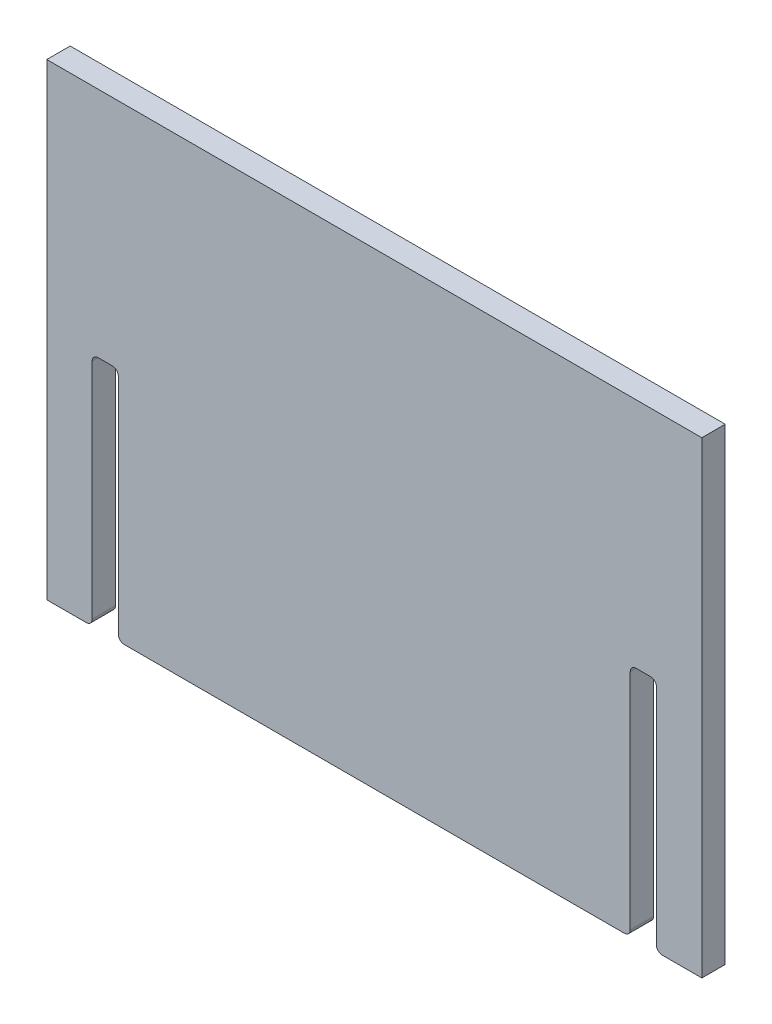
ISO-10303-21;
HEADER;
FILE_DESCRIPTION(('STEP AP214'),'2;1');
FILE_NAME('part.step','',(''),(''),'','','');
FILE_SCHEMA(('AUTOMOTIVE_DESIGN { 1 0 10303 214 1 1 1 1 }'));
ENDSEC;
DATA;
#1=APPLICATION_CONTEXT('core data for automotive mechanical design processes');
#2=APPLICATION_PROTOCOL_DEFINITION('international standard','automotive_design',2000,#1);
#3=PRODUCT_CONTEXT('',#1,'mechanical');
#4=PRODUCT('Part','Part','',(#3));
#5=PRODUCT_RELATED_PRODUCT_CATEGORY('part','',(#4));
#6=PRODUCT_DEFINITION_FORMATION('','',#4);
#7=PRODUCT_DEFINITION_CONTEXT('part definition',#1,'design');
#8=PRODUCT_DEFINITION('design','',#6,#7);
#9=PRODUCT_DEFINITION_SHAPE('','',#8);
#10=(LENGTH_UNIT() NAMED_UNIT(*) SI_UNIT(.MILLI.,.METRE.));
#11=(NAMED_UNIT(*) PLANE_ANGLE_UNIT() SI_UNIT($,.RADIAN.));
#12=(NAMED_UNIT(*) SI_UNIT($,.STERADIAN.) SOLID_ANGLE_UNIT());
#13=UNCERTAINTY_MEASURE_WITH_UNIT(LENGTH_MEASURE(1.E-05),#10,'distance_accuracy_value','');
#14=(GEOMETRIC_REPRESENTATION_CONTEXT(3) GLOBAL_UNCERTAINTY_ASSIGNED_CONTEXT((#13)) GLOBAL_UNIT_ASSIGNED_CONTEXT((#10,
#11,#12)) REPRESENTATION_CONTEXT('',''));
#15=CARTESIAN_POINT('',(0.,0.,0.));
#16=DIRECTION('',(0.,0.,1.));
#17=DIRECTION('',(1.,0.,0.));
#18=AXIS2_PLACEMENT_3D('',#15,#16,#17);
#19=CARTESIAN_POINT('',(1294.20395565763,-24.1798672236195,6.35));
#20=DIRECTION('',(1.,0.,0.));
#21=DIRECTION('',(0.,0.,-1.));
#22=AXIS2_PLACEMENT_3D('',#19,#20,#21);
#23=PLANE('',#22);
#24=DIRECTION('',(0.,-1.,0.));
#25=VECTOR('',#24,1.);
#26=CARTESIAN_POINT('',(1294.20395565763,-24.1798672236195,-6.35));
#27=LINE('',#26,#25);
#28=CARTESIAN_POINT('',(1294.20395565763,-24.1798672236195,-6.35));
#29=VERTEX_POINT('',#28);
#30=CARTESIAN_POINT('',(1294.20395565763,-278.17986722362,-6.35));
#31=VERTEX_POINT('',#30);
#32=EDGE_CURVE('E221',#29,#31,#27,.T.);
#33=ORIENTED_EDGE('',*,*,#32,.T.);
#34=DIRECTION('',(0.,0.,-1.));
#35=VECTOR('',#34,1.);
#36=CARTESIAN_POINT('',(1294.20395565763,-278.17986722362,6.35));
#37=LINE('',#36,#35);
#38=CARTESIAN_POINT('',(1294.20395565763,-278.17986722362,6.35));
#39=VERTEX_POINT('',#38);
#40=EDGE_CURVE('E200',#39,#31,#37,.T.);
#41=ORIENTED_EDGE('',*,*,#40,.F.);
#42=DIRECTION('',(0.,-1.,0.));
#43=VECTOR('',#42,1.);
#44=CARTESIAN_POINT('',(1294.20395565763,-24.1798672236195,6.35));
#45=LINE('',#44,#43);
#46=CARTESIAN_POINT('',(1294.20395565763,-24.1798672236195,6.35));
#47=VERTEX_POINT('',#46);
#48=EDGE_CURVE('E207',#47,#39,#45,.T.);
#49=ORIENTED_EDGE('',*,*,#48,.F.);
#50=DIRECTION('',(0.,0.,-1.));
#51=VECTOR('',#50,1.);
#52=CARTESIAN_POINT('',(1294.20395565763,-24.1798672236195,6.35));
#53=LINE('',#52,#51);
#54=EDGE_CURVE('E423',#47,#29,#53,.T.);
#55=ORIENTED_EDGE('',*,*,#54,.T.);
#56=EDGE_LOOP('',(#33,#41,#49,#55));
#57=FACE_BOUND('',#56,.T.);
#58=ADVANCED_FACE('F48',(#57),#23,.F.);
#59=CARTESIAN_POINT('',(1294.20395565763,-278.17986722362,6.35));
#60=DIRECTION('',(0.,1.,0.));
#61=DIRECTION('',(0.,0.,1.));
#62=AXIS2_PLACEMENT_3D('',#59,#60,#61);
#63=PLANE('',#62);
#64=DIRECTION('',(1.,0.,0.));
#65=VECTOR('',#64,1.);
#66=CARTESIAN_POINT('',(1294.20395565763,-278.17986722362,-6.35));
#67=LINE('',#66,#65);
#68=CARTESIAN_POINT('',(1315.66695565763,-278.17986722362,-6.35));
#69=VERTEX_POINT('',#68);
#70=EDGE_CURVE('E273',#31,#69,#67,.T.);
#71=ORIENTED_EDGE('',*,*,#70,.T.);
#72=DIRECTION('',(0.,0.,-1.));
#73=VECTOR('',#72,1.);
#74=CARTESIAN_POINT('',(1315.66695565763,-278.17986722362,6.35));
#75=LINE('',#74,#73);
#76=CARTESIAN_POINT('',(1315.66695565763,-278.17986722362,6.35));
#77=VERTEX_POINT('',#76);
#78=EDGE_CURVE('E203',#69,#77,#75,.F.);
#79=ORIENTED_EDGE('',*,*,#78,.T.);
#80=DIRECTION('',(1.,0.,0.));
#81=VECTOR('',#80,1.);
#82=CARTESIAN_POINT('',(1294.20395565763,-278.17986722362,6.35));
#83=LINE('',#82,#81);
#84=EDGE_CURVE('E195',#39,#77,#83,.T.);
#85=ORIENTED_EDGE('',*,*,#84,.F.);
#86=ORIENTED_EDGE('',*,*,#40,.T.);
#87=EDGE_LOOP('',(#71,#79,#85,#86));
#88=FACE_BOUND('',#87,.T.);
#89=ADVANCED_FACE('F198',(#88),#63,.F.);
#90=CARTESIAN_POINT('',(1318.84195565763,-278.17986722362,6.35));
#91=DIRECTION('',(-1.,0.,0.));
#92=DIRECTION('',(0.,0.,1.));
#93=AXIS2_PLACEMENT_3D('',#90,#91,#92);
#94=PLANE('',#93);
#95=DIRECTION('',(0.,1.,0.));
#96=VECTOR('',#95,1.);
#97=CARTESIAN_POINT('',(1318.84195565763,-278.17986722362,6.35));
#98=LINE('',#97,#96);
#99=CARTESIAN_POINT('',(1318.84195565763,-275.00486722362,6.35));
#100=VERTEX_POINT('',#99);
#101=CARTESIAN_POINT('',(1318.84195565763,-153.59286722362,6.35));
#102=VERTEX_POINT('',#101);
#103=EDGE_CURVE('E206',#100,#102,#98,.T.);
#104=ORIENTED_EDGE('',*,*,#103,.F.);
#105=DIRECTION('',(0.,0.,-1.));
#106=VECTOR('',#105,1.);
#107=CARTESIAN_POINT('',(1318.84195565763,-275.00486722362,6.35));
#108=LINE('',#107,#106);
#109=CARTESIAN_POINT('',(1318.84195565763,-275.00486722362,-6.35));
#110=VERTEX_POINT('',#109);
#111=EDGE_CURVE('E338',#100,#110,#108,.T.);
#112=ORIENTED_EDGE('',*,*,#111,.T.);
#113=DIRECTION('',(0.,1.,0.));
#114=VECTOR('',#113,1.);
#115=CARTESIAN_POINT('',(1318.84195565763,-278.17986722362,-6.35));
#116=LINE('',#115,#114);
#117=CARTESIAN_POINT('',(1318.84195565763,-153.59286722362,-6.35));
#118=VERTEX_POINT('',#117);
#119=EDGE_CURVE('E269',#110,#118,#116,.T.);
#120=ORIENTED_EDGE('',*,*,#119,.T.);
#121=DIRECTION('',(0.,0.,-1.));
#122=VECTOR('',#121,1.);
#123=CARTESIAN_POINT('',(1318.84195565763,-153.59286722362,6.35));
#124=LINE('',#123,#122);
#125=EDGE_CURVE('E335',#118,#102,#124,.F.);
#126=ORIENTED_EDGE('',*,*,#125,.T.);
#127=EDGE_LOOP('',(#104,#112,#120,#126));
#128=FACE_BOUND('',#127,.T.);
#129=ADVANCED_FACE('F386',(#128),#94,.F.);
#130=CARTESIAN_POINT('',(1319.60395565763,-150.41786722362,6.35));
#131=DIRECTION('',(0.,1.,0.));
#132=DIRECTION('',(0.,0.,1.));
#133=AXIS2_PLACEMENT_3D('',#130,#131,#132);
#134=PLANE('',#133);
#135=DIRECTION('',(1.,0.,0.));
#136=VECTOR('',#135,1.);
#137=CARTESIAN_POINT('',(1319.60395565763,-150.41786722362,-6.35));
#138=LINE('',#137,#136);
#139=CARTESIAN_POINT('',(1322.01695565763,-150.41786722362,-6.35));
#140=VERTEX_POINT('',#139);
#141=CARTESIAN_POINT('',(1329.89095565763,-150.41786722362,-6.35));
#142=VERTEX_POINT('',#141);
#143=EDGE_CURVE('E265',#140,#142,#138,.T.);
#144=ORIENTED_EDGE('',*,*,#143,.T.);
#145=DIRECTION('',(0.,0.,-1.));
#146=VECTOR('',#145,1.);
#147=CARTESIAN_POINT('',(1329.89095565763,-150.41786722362,6.35));
#148=LINE('',#147,#146);
#149=CARTESIAN_POINT('',(1329.89095565763,-150.41786722362,6.35));
#150=VERTEX_POINT('',#149);
#151=EDGE_CURVE('E355',#142,#150,#148,.F.);
#152=ORIENTED_EDGE('',*,*,#151,.T.);
#153=DIRECTION('',(1.,0.,0.));
#154=VECTOR('',#153,1.);
#155=CARTESIAN_POINT('',(1319.60395565763,-150.41786722362,6.35));
#156=LINE('',#155,#154);
#157=CARTESIAN_POINT('',(1322.01695565763,-150.41786722362,6.35));
#158=VERTEX_POINT('',#157);
#159=EDGE_CURVE('E277',#158,#150,#156,.T.);
#160=ORIENTED_EDGE('',*,*,#159,.F.);
#161=DIRECTION('',(0.,0.,-1.));
#162=VECTOR('',#161,1.);
#163=CARTESIAN_POINT('',(1322.01695565763,-150.41786722362,-6.35));
#164=LINE('',#163,#162);
#165=EDGE_CURVE('E351',#158,#140,#164,.T.);
#166=ORIENTED_EDGE('',*,*,#165,.T.);
#167=EDGE_LOOP('',(#144,#152,#160,#166));
#168=FACE_BOUND('',#167,.T.);
#169=ADVANCED_FACE('F392',(#168),#134,.F.);
#170=CARTESIAN_POINT('',(1333.06595565763,-151.17986722362,6.35));
#171=DIRECTION('',(1.,0.,0.));
#172=DIRECTION('',(0.,0.,-1.));
#173=AXIS2_PLACEMENT_3D('',#170,#171,#172);
#174=PLANE('',#173);
#175=DIRECTION('',(0.,-1.,0.));
#176=VECTOR('',#175,1.);
#177=CARTESIAN_POINT('',(1333.06595565763,-151.17986722362,-6.35));
#178=LINE('',#177,#176);
#179=CARTESIAN_POINT('',(1333.06595565763,-153.59286722362,-6.35));
#180=VERTEX_POINT('',#179);
#181=CARTESIAN_POINT('',(1333.06595565763,-275.00486722362,-6.35));
#182=VERTEX_POINT('',#181);
#183=EDGE_CURVE('E261',#180,#182,#178,.T.);
#184=ORIENTED_EDGE('',*,*,#183,.T.);
#185=DIRECTION('',(0.,0.,-1.));
#186=VECTOR('',#185,1.);
#187=CARTESIAN_POINT('',(1333.06595565763,-275.00486722362,6.35));
#188=LINE('',#187,#186);
#189=CARTESIAN_POINT('',(1333.06595565763,-275.00486722362,6.35));
#190=VERTEX_POINT('',#189);
#191=EDGE_CURVE('E332',#182,#190,#188,.F.);
#192=ORIENTED_EDGE('',*,*,#191,.T.);
#193=DIRECTION('',(0.,-1.,0.));
#194=VECTOR('',#193,1.);
#195=CARTESIAN_POINT('',(1333.06595565763,-151.17986722362,6.35));
#196=LINE('',#195,#194);
#197=CARTESIAN_POINT('',(1333.06595565763,-153.59286722362,6.35));
#198=VERTEX_POINT('',#197);
#199=EDGE_CURVE('E281',#198,#190,#196,.T.);
#200=ORIENTED_EDGE('',*,*,#199,.F.);
#201=DIRECTION('',(0.,0.,-1.));
#202=VECTOR('',#201,1.);
#203=CARTESIAN_POINT('',(1333.06595565763,-153.59286722362,-6.35));
#204=LINE('',#203,#202);
#205=EDGE_CURVE('E328',#198,#180,#204,.T.);
#206=ORIENTED_EDGE('',*,*,#205,.T.);
#207=EDGE_LOOP('',(#184,#192,#200,#206));
#208=FACE_BOUND('',#207,.T.);
#209=ADVANCED_FACE('F400',(#208),#174,.F.);
#210=CARTESIAN_POINT('',(1332.30395565763,-278.17986722362,6.35));
#211=DIRECTION('',(0.,1.,0.));
#212=DIRECTION('',(0.,0.,1.));
#213=AXIS2_PLACEMENT_3D('',#210,#211,#212);
#214=PLANE('',#213);
#215=DIRECTION('',(1.,0.,0.));
#216=VECTOR('',#215,1.);
#217=CARTESIAN_POINT('',(1332.30395565763,-278.17986722362,-6.35));
#218=LINE('',#217,#216);
#219=CARTESIAN_POINT('',(1336.24095565763,-278.17986722362,-6.35));
#220=VERTEX_POINT('',#219);
#221=CARTESIAN_POINT('',(1607.76695565763,-278.17986722362,-6.35));
#222=VERTEX_POINT('',#221);
#223=EDGE_CURVE('E240',#220,#222,#218,.T.);
#224=ORIENTED_EDGE('',*,*,#223,.T.);
#225=DIRECTION('',(0.,0.,-1.));
#226=VECTOR('',#225,1.);
#227=CARTESIAN_POINT('',(1607.76695565763,-278.17986722362,6.35));
#228=LINE('',#227,#226);
#229=CARTESIAN_POINT('',(1607.76695565763,-278.17986722362,6.35));
#230=VERTEX_POINT('',#229);
#231=EDGE_CURVE('E304',#222,#230,#228,.F.);
#232=ORIENTED_EDGE('',*,*,#231,.T.);
#233=DIRECTION('',(1.,0.,0.));
#234=VECTOR('',#233,1.);
#235=CARTESIAN_POINT('',(1332.30395565763,-278.17986722362,6.35));
#236=LINE('',#235,#234);
#237=CARTESIAN_POINT('',(1336.24095565763,-278.17986722362,6.35));
#238=VERTEX_POINT('',#237);
#239=EDGE_CURVE('E246',#238,#230,#236,.T.);
#240=ORIENTED_EDGE('',*,*,#239,.F.);
#241=DIRECTION('',(0.,0.,-1.));
#242=VECTOR('',#241,1.);
#243=CARTESIAN_POINT('',(1336.24095565763,-278.17986722362,6.35));
#244=LINE('',#243,#242);
#245=EDGE_CURVE('E300',#238,#220,#244,.T.);
#246=ORIENTED_EDGE('',*,*,#245,.T.);
#247=EDGE_LOOP('',(#224,#232,#240,#246));
#248=FACE_BOUND('',#247,.T.);
#249=ADVANCED_FACE('F410',(#248),#214,.F.);
#250=CARTESIAN_POINT('',(1610.94195565763,-278.17986722362,6.35));
#251=DIRECTION('',(-1.,0.,0.));
#252=DIRECTION('',(0.,0.,1.));
#253=AXIS2_PLACEMENT_3D('',#250,#251,#252);
#254=PLANE('',#253);
#255=DIRECTION('',(0.,1.,0.));
#256=VECTOR('',#255,1.);
#257=CARTESIAN_POINT('',(1610.94195565763,-278.17986722362,6.35));
#258=LINE('',#257,#256);
#259=CARTESIAN_POINT('',(1610.94195565763,-275.00486722362,6.35));
#260=VERTEX_POINT('',#259);
#261=CARTESIAN_POINT('',(1610.94195565763,-153.59286722362,6.35));
#262=VERTEX_POINT('',#261);
#263=EDGE_CURVE('E241',#260,#262,#258,.T.);
#264=ORIENTED_EDGE('',*,*,#263,.F.);
#265=DIRECTION('',(0.,0.,-1.));
#266=VECTOR('',#265,1.);
#267=CARTESIAN_POINT('',(1610.94195565763,-275.00486722362,6.35));
#268=LINE('',#267,#266);
#269=CARTESIAN_POINT('',(1610.94195565763,-275.00486722362,-6.35));
#270=VERTEX_POINT('',#269);
#271=EDGE_CURVE('E228',#260,#270,#268,.T.);
#272=ORIENTED_EDGE('',*,*,#271,.T.);
#273=DIRECTION('',(0.,1.,0.));
#274=VECTOR('',#273,1.);
#275=CARTESIAN_POINT('',(1610.94195565763,-278.17986722362,-6.35));
#276=LINE('',#275,#274);
#277=CARTESIAN_POINT('',(1610.94195565763,-153.59286722362,-6.35));
#278=VERTEX_POINT('',#277);
#279=EDGE_CURVE('E235',#270,#278,#276,.T.);
#280=ORIENTED_EDGE('',*,*,#279,.T.);
#281=DIRECTION('',(0.,0.,-1.));
#282=VECTOR('',#281,1.);
#283=CARTESIAN_POINT('',(1610.94195565763,-153.59286722362,6.35));
#284=LINE('',#283,#282);
#285=EDGE_CURVE('E223',#278,#262,#284,.F.);
#286=ORIENTED_EDGE('',*,*,#285,.T.);
#287=EDGE_LOOP('',(#264,#272,#280,#286));
#288=FACE_BOUND('',#287,.T.);
#289=ADVANCED_FACE('F470',(#288),#254,.F.);
#290=CARTESIAN_POINT('',(1611.70395565763,-150.41786722362,6.35));
#291=DIRECTION('',(0.,1.,0.));
#292=DIRECTION('',(0.,0.,1.));
#293=AXIS2_PLACEMENT_3D('',#290,#291,#292);
#294=PLANE('',#293);
#295=DIRECTION('',(1.,0.,0.));
#296=VECTOR('',#295,1.);
#297=CARTESIAN_POINT('',(1611.70395565763,-150.41786722362,-6.35));
#298=LINE('',#297,#296);
#299=CARTESIAN_POINT('',(1614.11695565763,-150.41786722362,-6.35));
#300=VERTEX_POINT('',#299);
#301=CARTESIAN_POINT('',(1621.99095565763,-150.41786722362,-6.35));
#302=VERTEX_POINT('',#301);
#303=EDGE_CURVE('E239',#300,#302,#298,.T.);
#304=ORIENTED_EDGE('',*,*,#303,.T.);
#305=DIRECTION('',(0.,0.,-1.));
#306=VECTOR('',#305,1.);
#307=CARTESIAN_POINT('',(1621.99095565763,-150.41786722362,6.35));
#308=LINE('',#307,#306);
#309=CARTESIAN_POINT('',(1621.99095565763,-150.41786722362,6.35));
#310=VERTEX_POINT('',#309);
#311=EDGE_CURVE('E348',#302,#310,#308,.F.);
#312=ORIENTED_EDGE('',*,*,#311,.T.);
#313=DIRECTION('',(1.,0.,0.));
#314=VECTOR('',#313,1.);
#315=CARTESIAN_POINT('',(1611.70395565763,-150.41786722362,6.35));
#316=LINE('',#315,#314);
#317=CARTESIAN_POINT('',(1614.11695565763,-150.41786722362,6.35));
#318=VERTEX_POINT('',#317);
#319=EDGE_CURVE('E245',#318,#310,#316,.T.);
#320=ORIENTED_EDGE('',*,*,#319,.F.);
#321=DIRECTION('',(0.,0.,-1.));
#322=VECTOR('',#321,1.);
#323=CARTESIAN_POINT('',(1614.11695565763,-150.41786722362,-6.35));
#324=LINE('',#323,#322);
#325=EDGE_CURVE('E344',#318,#300,#324,.T.);
#326=ORIENTED_EDGE('',*,*,#325,.T.);
#327=EDGE_LOOP('',(#304,#312,#320,#326));
#328=FACE_BOUND('',#327,.T.);
#329=ADVANCED_FACE('F473',(#328),#294,.F.);
#330=CARTESIAN_POINT('',(1625.16595565763,-151.17986722362,6.35));
#331=DIRECTION('',(1.,0.,0.));
#332=DIRECTION('',(0.,0.,-1.));
#333=AXIS2_PLACEMENT_3D('',#330,#331,#332);
#334=PLANE('',#333);
#335=DIRECTION('',(0.,-1.,0.));
#336=VECTOR('',#335,1.);
#337=CARTESIAN_POINT('',(1625.16595565763,-151.17986722362,-6.35));
#338=LINE('',#337,#336);
#339=CARTESIAN_POINT('',(1625.16595565763,-153.59286722362,-6.35));
#340=VERTEX_POINT('',#339);
#341=CARTESIAN_POINT('',(1625.16595565763,-275.00486722362,-6.35));
#342=VERTEX_POINT('',#341);
#343=EDGE_CURVE('E254',#340,#342,#338,.T.);
#344=ORIENTED_EDGE('',*,*,#343,.T.);
#345=DIRECTION('',(0.,0.,-1.));
#346=VECTOR('',#345,1.);
#347=CARTESIAN_POINT('',(1625.16595565763,-275.00486722362,6.35));
#348=LINE('',#347,#346);
#349=CARTESIAN_POINT('',(1625.16595565763,-275.00486722362,6.35));
#350=VERTEX_POINT('',#349);
#351=EDGE_CURVE('E76',#342,#350,#348,.F.);
#352=ORIENTED_EDGE('',*,*,#351,.T.);
#353=DIRECTION('',(0.,-1.,0.));
#354=VECTOR('',#353,1.);
#355=CARTESIAN_POINT('',(1625.16595565763,-151.17986722362,6.35));
#356=LINE('',#355,#354);
#357=CARTESIAN_POINT('',(1625.16595565763,-153.59286722362,6.35));
#358=VERTEX_POINT('',#357);
#359=EDGE_CURVE('E250',#358,#350,#356,.T.);
#360=ORIENTED_EDGE('',*,*,#359,.F.);
#361=DIRECTION('',(0.,0.,-1.));
#362=VECTOR('',#361,1.);
#363=CARTESIAN_POINT('',(1625.16595565763,-153.59286722362,-6.35));
#364=LINE('',#363,#362);
#365=EDGE_CURVE('E322',#358,#340,#364,.T.);
#366=ORIENTED_EDGE('',*,*,#365,.T.);
#367=EDGE_LOOP('',(#344,#352,#360,#366));
#368=FACE_BOUND('',#367,.T.);
#369=ADVANCED_FACE('F475',(#368),#334,.F.);
#370=CARTESIAN_POINT('',(1624.40395565763,-278.17986722362,6.35));
#371=DIRECTION('',(0.,1.,0.));
#372=DIRECTION('',(0.,0.,1.));
#373=AXIS2_PLACEMENT_3D('',#370,#371,#372);
#374=PLANE('',#373);
#375=DIRECTION('',(1.,0.,0.));
#376=VECTOR('',#375,1.);
#377=CARTESIAN_POINT('',(1624.40395565763,-278.17986722362,6.35));
#378=LINE('',#377,#376);
#379=CARTESIAN_POINT('',(1628.34095565763,-278.17986722362,6.35));
#380=VERTEX_POINT('',#379);
#381=CARTESIAN_POINT('',(1649.80395565763,-278.17986722362,6.35));
#382=VERTEX_POINT('',#381);
#383=EDGE_CURVE('E253',#380,#382,#378,.T.);
#384=ORIENTED_EDGE('',*,*,#383,.F.);
#385=DIRECTION('',(0.,0.,-1.));
#386=VECTOR('',#385,1.);
#387=CARTESIAN_POINT('',(1628.34095565763,-278.17986722362,6.35));
#388=LINE('',#387,#386);
#389=CARTESIAN_POINT('',(1628.34095565763,-278.17986722362,-6.35));
#390=VERTEX_POINT('',#389);
#391=EDGE_CURVE('E318',#380,#390,#388,.T.);
#392=ORIENTED_EDGE('',*,*,#391,.T.);
#393=DIRECTION('',(1.,0.,0.));
#394=VECTOR('',#393,1.);
#395=CARTESIAN_POINT('',(1624.40395565763,-278.17986722362,-6.35));
#396=LINE('',#395,#394);
#397=CARTESIAN_POINT('',(1649.80395565763,-278.17986722362,-6.35));
#398=VERTEX_POINT('',#397);
#399=EDGE_CURVE('E257',#390,#398,#396,.T.);
#400=ORIENTED_EDGE('',*,*,#399,.T.);
#401=DIRECTION('',(0.,0.,-1.));
#402=VECTOR('',#401,1.);
#403=CARTESIAN_POINT('',(1649.80395565763,-278.17986722362,6.35));
#404=LINE('',#403,#402);
#405=EDGE_CURVE('E224',#382,#398,#404,.T.);
#406=ORIENTED_EDGE('',*,*,#405,.F.);
#407=EDGE_LOOP('',(#384,#392,#400,#406));
#408=FACE_BOUND('',#407,.T.);
#409=ADVANCED_FACE('F478',(#408),#374,.F.);
#410=CARTESIAN_POINT('',(1649.80395565763,-24.1798672236195,6.35));
#411=DIRECTION('',(-1.,0.,0.));
#412=DIRECTION('',(0.,0.,1.));
#413=AXIS2_PLACEMENT_3D('',#410,#411,#412);
#414=PLANE('',#413);
#415=DIRECTION('',(0.,1.,0.));
#416=VECTOR('',#415,1.);
#417=CARTESIAN_POINT('',(1649.80395565763,-24.1798672236195,-6.35));
#418=LINE('',#417,#416);
#419=CARTESIAN_POINT('',(1649.80395565763,-24.1798672236195,-6.35));
#420=VERTEX_POINT('',#419);
#421=EDGE_CURVE('E432',#398,#420,#418,.T.);
#422=ORIENTED_EDGE('',*,*,#421,.T.);
#423=DIRECTION('',(0.,0.,-1.));
#424=VECTOR('',#423,1.);
#425=CARTESIAN_POINT('',(1649.80395565763,-24.1798672236195,6.35));
#426=LINE('',#425,#424);
#427=CARTESIAN_POINT('',(1649.80395565763,-24.1798672236195,6.35));
#428=VERTEX_POINT('',#427);
#429=EDGE_CURVE('E231',#428,#420,#426,.T.);
#430=ORIENTED_EDGE('',*,*,#429,.F.);
#431=DIRECTION('',(0.,1.,0.));
#432=VECTOR('',#431,1.);
#433=CARTESIAN_POINT('',(1649.80395565763,-24.1798672236195,6.35));
#434=LINE('',#433,#432);
#435=EDGE_CURVE('E418',#382,#428,#434,.T.);
#436=ORIENTED_EDGE('',*,*,#435,.F.);
#437=ORIENTED_EDGE('',*,*,#405,.T.);
#438=EDGE_LOOP('',(#422,#430,#436,#437));
#439=FACE_BOUND('',#438,.T.);
#440=ADVANCED_FACE('F593',(#439),#414,.F.);
#441=CARTESIAN_POINT('',(1294.20395565763,-24.1798672236195,6.35));
#442=DIRECTION('',(0.,-1.,0.));
#443=DIRECTION('',(0.,0.,-1.));
#444=AXIS2_PLACEMENT_3D('',#441,#442,#443);
#445=PLANE('',#444);
#446=DIRECTION('',(-1.,0.,0.));
#447=VECTOR('',#446,1.);
#448=CARTESIAN_POINT('',(1294.20395565763,-24.1798672236195,-6.35));
#449=LINE('',#448,#447);
#450=EDGE_CURVE('E218',#420,#29,#449,.T.);
#451=ORIENTED_EDGE('',*,*,#450,.T.);
#452=ORIENTED_EDGE('',*,*,#54,.F.);
#453=DIRECTION('',(-1.,0.,0.));
#454=VECTOR('',#453,1.);
#455=CARTESIAN_POINT('',(1294.20395565763,-24.1798672236195,6.35));
#456=LINE('',#455,#454);
#457=EDGE_CURVE('E213',#428,#47,#456,.T.);
#458=ORIENTED_EDGE('',*,*,#457,.F.);
#459=ORIENTED_EDGE('',*,*,#429,.T.);
#460=EDGE_LOOP('',(#451,#452,#458,#459));
#461=FACE_BOUND('',#460,.T.);
#462=ADVANCED_FACE('F443',(#461),#445,.F.);
#463=CARTESIAN_POINT('',(0.,0.,6.35));
#464=DIRECTION('',(0.,0.,1.));
#465=DIRECTION('',(1.,0.,0.));
#466=AXIS2_PLACEMENT_3D('',#463,#464,#465);
#467=PLANE('',#466);
#468=ORIENTED_EDGE('',*,*,#239,.T.);
#469=CARTESIAN_POINT('',(1607.76695565763,-275.00486722362,6.35));
#470=DIRECTION('',(0.,0.,1.));
#471=DIRECTION('',(1.,0.,0.));
#472=AXIS2_PLACEMENT_3D('',#469,#470,#471);
#473=CIRCLE('',#472,3.175);
#474=EDGE_CURVE('E315',#230,#260,#473,.T.);
#475=ORIENTED_EDGE('',*,*,#474,.T.);
#476=ORIENTED_EDGE('',*,*,#263,.T.);
#477=CARTESIAN_POINT('',(1614.11695565763,-153.59286722362,6.35));
#478=DIRECTION('',(0.,0.,1.));
#479=DIRECTION('',(1.,0.,0.));
#480=AXIS2_PLACEMENT_3D('',#477,#478,#479);
#481=CIRCLE('',#480,3.175);
#482=EDGE_CURVE('E367',#262,#318,#481,.F.);
#483=ORIENTED_EDGE('',*,*,#482,.T.);
#484=ORIENTED_EDGE('',*,*,#319,.T.);
#485=CARTESIAN_POINT('',(1621.99095565763,-153.59286722362,6.35));
#486=DIRECTION('',(0.,0.,1.));
#487=DIRECTION('',(1.,0.,0.));
#488=AXIS2_PLACEMENT_3D('',#485,#486,#487);
#489=CIRCLE('',#488,3.175);
#490=EDGE_CURVE('E361',#310,#358,#489,.F.);
#491=ORIENTED_EDGE('',*,*,#490,.T.);
#492=ORIENTED_EDGE('',*,*,#359,.T.);
#493=CARTESIAN_POINT('',(1628.34095565763,-275.00486722362,6.35));
#494=DIRECTION('',(0.,0.,1.));
#495=DIRECTION('',(1.,0.,0.));
#496=AXIS2_PLACEMENT_3D('',#493,#494,#495);
#497=CIRCLE('',#496,3.175);
#498=EDGE_CURVE('E67',#350,#380,#497,.T.);
#499=ORIENTED_EDGE('',*,*,#498,.T.);
#500=ORIENTED_EDGE('',*,*,#383,.T.);
#501=ORIENTED_EDGE('',*,*,#435,.T.);
#502=ORIENTED_EDGE('',*,*,#457,.T.);
#503=ORIENTED_EDGE('',*,*,#48,.T.);
#504=ORIENTED_EDGE('',*,*,#84,.T.);
#505=CARTESIAN_POINT('',(1315.66695565763,-275.00486722362,6.35));
#506=DIRECTION('',(0.,0.,1.));
#507=DIRECTION('',(1.,0.,0.));
#508=AXIS2_PLACEMENT_3D('',#505,#506,#507);
#509=CIRCLE('',#508,3.175);
#510=EDGE_CURVE('E307',#77,#100,#509,.T.);
#511=ORIENTED_EDGE('',*,*,#510,.T.);
#512=ORIENTED_EDGE('',*,*,#103,.T.);
#513=CARTESIAN_POINT('',(1322.01695565763,-153.59286722362,6.35));
#514=DIRECTION('',(0.,0.,1.));
#515=DIRECTION('',(1.,0.,0.));
#516=AXIS2_PLACEMENT_3D('',#513,#514,#515);
#517=CIRCLE('',#516,3.175);
#518=EDGE_CURVE('E12',#102,#158,#517,.F.);
#519=ORIENTED_EDGE('',*,*,#518,.T.);
#520=ORIENTED_EDGE('',*,*,#159,.T.);
#521=CARTESIAN_POINT('',(1329.89095565763,-153.59286722362,6.35));
#522=DIRECTION('',(0.,0.,1.));
#523=DIRECTION('',(1.,0.,0.));
#524=AXIS2_PLACEMENT_3D('',#521,#522,#523);
#525=CIRCLE('',#524,3.175);
#526=EDGE_CURVE('E373',#150,#198,#525,.F.);
#527=ORIENTED_EDGE('',*,*,#526,.T.);
#528=ORIENTED_EDGE('',*,*,#199,.T.);
#529=CARTESIAN_POINT('',(1336.24095565763,-275.00486722362,6.35));
#530=DIRECTION('',(0.,0.,1.));
#531=DIRECTION('',(1.,0.,0.));
#532=AXIS2_PLACEMENT_3D('',#529,#530,#531);
#533=CIRCLE('',#532,3.175);
#534=EDGE_CURVE('E310',#190,#238,#533,.T.);
#535=ORIENTED_EDGE('',*,*,#534,.T.);
#536=EDGE_LOOP('',(#468,#475,#476,#483,#484,#491,#492,#499,#500,#501,#502,#503,#504,#511,#512,
#519,#520,#527,#528,#535));
#537=FACE_BOUND('',#536,.T.);
#538=ADVANCED_FACE('F211',(#537),#467,.T.);
#539=CARTESIAN_POINT('',(0.,0.,-6.35));
#540=DIRECTION('',(0.,0.,1.));
#541=DIRECTION('',(1.,0.,0.));
#542=AXIS2_PLACEMENT_3D('',#539,#540,#541);
#543=PLANE('',#542);
#544=ORIENTED_EDGE('',*,*,#279,.F.);
#545=CARTESIAN_POINT('',(1607.76695565763,-275.00486722362,-6.35));
#546=DIRECTION('',(0.,0.,1.));
#547=DIRECTION('',(1.,0.,0.));
#548=AXIS2_PLACEMENT_3D('',#545,#546,#547);
#549=CIRCLE('',#548,3.175);
#550=EDGE_CURVE('E297',#270,#222,#549,.F.);
#551=ORIENTED_EDGE('',*,*,#550,.T.);
#552=ORIENTED_EDGE('',*,*,#223,.F.);
#553=CARTESIAN_POINT('',(1336.24095565763,-275.00486722362,-6.35));
#554=DIRECTION('',(0.,0.,1.));
#555=DIRECTION('',(1.,0.,0.));
#556=AXIS2_PLACEMENT_3D('',#553,#554,#555);
#557=CIRCLE('',#556,3.175);
#558=EDGE_CURVE('E291',#220,#182,#557,.F.);
#559=ORIENTED_EDGE('',*,*,#558,.T.);
#560=ORIENTED_EDGE('',*,*,#183,.F.);
#561=CARTESIAN_POINT('',(1329.89095565763,-153.59286722362,-6.35));
#562=DIRECTION('',(0.,0.,1.));
#563=DIRECTION('',(1.,0.,0.));
#564=AXIS2_PLACEMENT_3D('',#561,#562,#563);
#565=CIRCLE('',#564,3.175);
#566=EDGE_CURVE('E370',#180,#142,#565,.T.);
#567=ORIENTED_EDGE('',*,*,#566,.T.);
#568=ORIENTED_EDGE('',*,*,#143,.F.);
#569=CARTESIAN_POINT('',(1322.01695565763,-153.59286722362,-6.35));
#570=DIRECTION('',(0.,0.,1.));
#571=DIRECTION('',(1.,0.,0.));
#572=AXIS2_PLACEMENT_3D('',#569,#570,#571);
#573=CIRCLE('',#572,3.175);
#574=EDGE_CURVE('E57',#140,#118,#573,.T.);
#575=ORIENTED_EDGE('',*,*,#574,.T.);
#576=ORIENTED_EDGE('',*,*,#119,.F.);
#577=CARTESIAN_POINT('',(1315.66695565763,-275.00486722362,-6.35));
#578=DIRECTION('',(0.,0.,1.));
#579=DIRECTION('',(1.,0.,0.));
#580=AXIS2_PLACEMENT_3D('',#577,#578,#579);
#581=CIRCLE('',#580,3.175);
#582=EDGE_CURVE('E288',#110,#69,#581,.F.);
#583=ORIENTED_EDGE('',*,*,#582,.T.);
#584=ORIENTED_EDGE('',*,*,#70,.F.);
#585=ORIENTED_EDGE('',*,*,#32,.F.);
#586=ORIENTED_EDGE('',*,*,#450,.F.);
#587=ORIENTED_EDGE('',*,*,#421,.F.);
#588=ORIENTED_EDGE('',*,*,#399,.F.);
#589=CARTESIAN_POINT('',(1628.34095565763,-275.00486722362,-6.35));
#590=DIRECTION('',(0.,0.,1.));
#591=DIRECTION('',(1.,0.,0.));
#592=AXIS2_PLACEMENT_3D('',#589,#590,#591);
#593=CIRCLE('',#592,3.175);
#594=EDGE_CURVE('E294',#390,#342,#593,.F.);
#595=ORIENTED_EDGE('',*,*,#594,.T.);
#596=ORIENTED_EDGE('',*,*,#343,.F.);
#597=CARTESIAN_POINT('',(1621.99095565763,-153.59286722362,-6.35));
#598=DIRECTION('',(0.,0.,1.));
#599=DIRECTION('',(1.,0.,0.));
#600=AXIS2_PLACEMENT_3D('',#597,#598,#599);
#601=CIRCLE('',#600,3.175);
#602=EDGE_CURVE('E358',#340,#302,#601,.T.);
#603=ORIENTED_EDGE('',*,*,#602,.T.);
#604=ORIENTED_EDGE('',*,*,#303,.F.);
#605=CARTESIAN_POINT('',(1614.11695565763,-153.59286722362,-6.35));
#606=DIRECTION('',(0.,0.,1.));
#607=DIRECTION('',(1.,0.,0.));
#608=AXIS2_PLACEMENT_3D('',#605,#606,#607);
#609=CIRCLE('',#608,3.175);
#610=EDGE_CURVE('E364',#300,#278,#609,.T.);
#611=ORIENTED_EDGE('',*,*,#610,.T.);
#612=EDGE_LOOP('',(#544,#551,#552,#559,#560,#567,#568,#575,#576,#583,#584,#585,#586,#587,#588,
#595,#596,#603,#604,#611));
#613=FACE_BOUND('',#612,.T.);
#614=ADVANCED_FACE('F380',(#613),#543,.F.);
#615=CARTESIAN_POINT('',(1607.76695565763,-275.00486722362,6.35));
#616=DIRECTION('',(0.,0.,-1.));
#617=DIRECTION('',(-1.,0.,0.));
#618=AXIS2_PLACEMENT_3D('',#615,#616,#617);
#619=CYLINDRICAL_SURFACE('',#618,3.175);
#620=ORIENTED_EDGE('',*,*,#474,.F.);
#621=ORIENTED_EDGE('',*,*,#231,.F.);
#622=ORIENTED_EDGE('',*,*,#550,.F.);
#623=ORIENTED_EDGE('',*,*,#271,.F.);
#624=EDGE_LOOP('',(#620,#621,#622,#623));
#625=FACE_BOUND('',#624,.T.);
#626=ADVANCED_FACE('F488',(#625),#619,.T.);
#627=CARTESIAN_POINT('',(1628.34095565763,-275.00486722362,6.35));
#628=DIRECTION('',(0.,0.,-1.));
#629=DIRECTION('',(-1.,0.,0.));
#630=AXIS2_PLACEMENT_3D('',#627,#628,#629);
#631=CYLINDRICAL_SURFACE('',#630,3.175);
#632=ORIENTED_EDGE('',*,*,#498,.F.);
#633=ORIENTED_EDGE('',*,*,#351,.F.);
#634=ORIENTED_EDGE('',*,*,#594,.F.);
#635=ORIENTED_EDGE('',*,*,#391,.F.);
#636=EDGE_LOOP('',(#632,#633,#634,#635));
#637=FACE_BOUND('',#636,.T.);
#638=ADVANCED_FACE('F460',(#637),#631,.T.);
#639=CARTESIAN_POINT('',(1336.24095565763,-275.00486722362,6.35));
#640=DIRECTION('',(0.,0.,-1.));
#641=DIRECTION('',(-1.,0.,0.));
#642=AXIS2_PLACEMENT_3D('',#639,#640,#641);
#643=CYLINDRICAL_SURFACE('',#642,3.175);
#644=ORIENTED_EDGE('',*,*,#534,.F.);
#645=ORIENTED_EDGE('',*,*,#191,.F.);
#646=ORIENTED_EDGE('',*,*,#558,.F.);
#647=ORIENTED_EDGE('',*,*,#245,.F.);
#648=EDGE_LOOP('',(#644,#645,#646,#647));
#649=FACE_BOUND('',#648,.T.);
#650=ADVANCED_FACE('F404',(#649),#643,.T.);
#651=CARTESIAN_POINT('',(1315.66695565763,-275.00486722362,6.35));
#652=DIRECTION('',(0.,0.,-1.));
#653=DIRECTION('',(-1.,0.,0.));
#654=AXIS2_PLACEMENT_3D('',#651,#652,#653);
#655=CYLINDRICAL_SURFACE('',#654,3.175);
#656=ORIENTED_EDGE('',*,*,#510,.F.);
#657=ORIENTED_EDGE('',*,*,#78,.F.);
#658=ORIENTED_EDGE('',*,*,#582,.F.);
#659=ORIENTED_EDGE('',*,*,#111,.F.);
#660=EDGE_LOOP('',(#656,#657,#658,#659));
#661=FACE_BOUND('',#660,.T.);
#662=ADVANCED_FACE('F449',(#661),#655,.T.);
#663=CARTESIAN_POINT('',(1621.99095565763,-153.59286722362,6.35));
#664=DIRECTION('',(0.,0.,1.));
#665=DIRECTION('',(1.,0.,0.));
#666=AXIS2_PLACEMENT_3D('',#663,#664,#665);
#667=CYLINDRICAL_SURFACE('',#666,3.175);
#668=ORIENTED_EDGE('',*,*,#490,.F.);
#669=ORIENTED_EDGE('',*,*,#311,.F.);
#670=ORIENTED_EDGE('',*,*,#602,.F.);
#671=ORIENTED_EDGE('',*,*,#365,.F.);
#672=EDGE_LOOP('',(#668,#669,#670,#671));
#673=FACE_BOUND('',#672,.T.);
#674=ADVANCED_FACE('F451',(#673),#667,.F.);
#675=CARTESIAN_POINT('',(1614.11695565763,-153.59286722362,6.35));
#676=DIRECTION('',(0.,0.,1.));
#677=DIRECTION('',(1.,0.,0.));
#678=AXIS2_PLACEMENT_3D('',#675,#676,#677);
#679=CYLINDRICAL_SURFACE('',#678,3.175);
#680=ORIENTED_EDGE('',*,*,#482,.F.);
#681=ORIENTED_EDGE('',*,*,#285,.F.);
#682=ORIENTED_EDGE('',*,*,#610,.F.);
#683=ORIENTED_EDGE('',*,*,#325,.F.);
#684=EDGE_LOOP('',(#680,#681,#682,#683));
#685=FACE_BOUND('',#684,.T.);
#686=ADVANCED_FACE('F457',(#685),#679,.F.);
#687=CARTESIAN_POINT('',(1329.89095565763,-153.59286722362,6.35));
#688=DIRECTION('',(0.,0.,1.));
#689=DIRECTION('',(1.,0.,0.));
#690=AXIS2_PLACEMENT_3D('',#687,#688,#689);
#691=CYLINDRICAL_SURFACE('',#690,3.175);
#692=ORIENTED_EDGE('',*,*,#526,.F.);
#693=ORIENTED_EDGE('',*,*,#151,.F.);
#694=ORIENTED_EDGE('',*,*,#566,.F.);
#695=ORIENTED_EDGE('',*,*,#205,.F.);
#696=EDGE_LOOP('',(#692,#693,#694,#695));
#697=FACE_BOUND('',#696,.T.);
#698=ADVANCED_FACE('F395',(#697),#691,.F.);
#699=CARTESIAN_POINT('',(1322.01695565763,-153.59286722362,6.35));
#700=DIRECTION('',(0.,0.,1.));
#701=DIRECTION('',(1.,0.,0.));
#702=AXIS2_PLACEMENT_3D('',#699,#700,#701);
#703=CYLINDRICAL_SURFACE('',#702,3.175);
#704=ORIENTED_EDGE('',*,*,#518,.F.);
#705=ORIENTED_EDGE('',*,*,#125,.F.);
#706=ORIENTED_EDGE('',*,*,#574,.F.);
#707=ORIENTED_EDGE('',*,*,#165,.F.);
#708=EDGE_LOOP('',(#704,#705,#706,#707));
#709=FACE_BOUND('',#708,.T.);
#710=ADVANCED_FACE('F50',(#709),#703,.F.);
#711=CLOSED_SHELL('',(#58,#89,#129,#169,#209,#249,#289,#329,#369,#409,#440,#462,#538,#614,#626,
#638,#650,#662,#674,#686,#698,#710));
#712=MANIFOLD_SOLID_BREP('B2',#711);
#713=ADVANCED_BREP_SHAPE_REPRESENTATION('',(#18,#712),#14);
#714=SHAPE_DEFINITION_REPRESENTATION(#9,#713);
ENDSEC;
END-ISO-10303-21;
